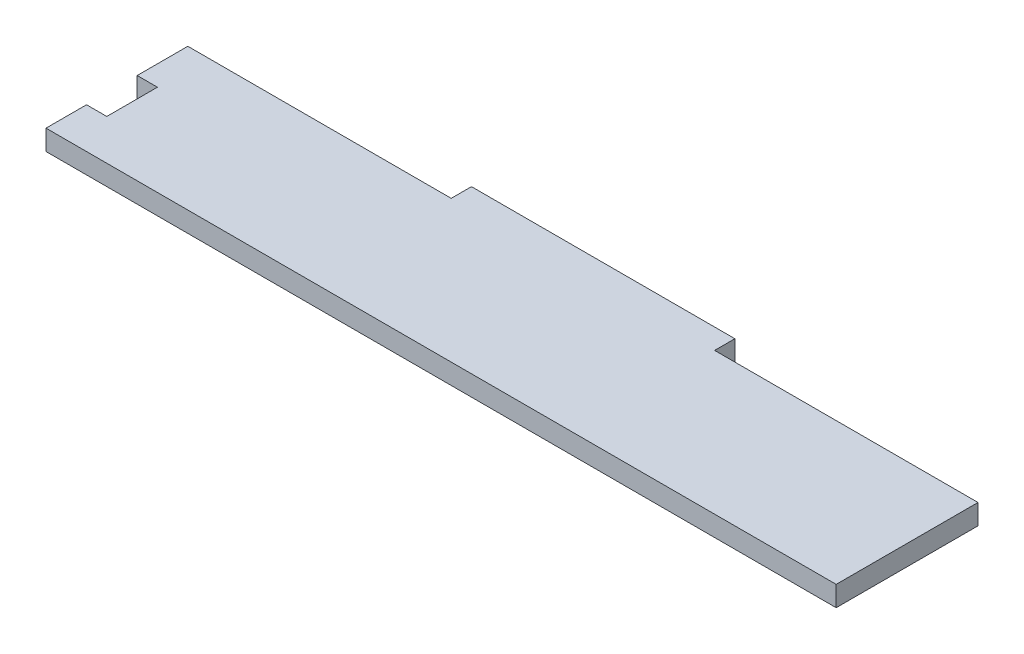
ISO-10303-21;
HEADER;
FILE_DESCRIPTION(('STEP AP214'),'2;1');
FILE_NAME('part.step','',(''),(''),'','','');
FILE_SCHEMA(('AUTOMOTIVE_DESIGN { 1 0 10303 214 1 1 1 1 }'));
ENDSEC;
DATA;
#1=APPLICATION_CONTEXT('core data for automotive mechanical design processes');
#2=APPLICATION_PROTOCOL_DEFINITION('international standard','automotive_design',2000,#1);
#3=PRODUCT_CONTEXT('',#1,'mechanical');
#4=PRODUCT('Part','Part','',(#3));
#5=PRODUCT_RELATED_PRODUCT_CATEGORY('part','',(#4));
#6=PRODUCT_DEFINITION_FORMATION('','',#4);
#7=PRODUCT_DEFINITION_CONTEXT('part definition',#1,'design');
#8=PRODUCT_DEFINITION('design','',#6,#7);
#9=PRODUCT_DEFINITION_SHAPE('','',#8);
#10=(LENGTH_UNIT() NAMED_UNIT(*) SI_UNIT(.MILLI.,.METRE.));
#11=(NAMED_UNIT(*) PLANE_ANGLE_UNIT() SI_UNIT($,.RADIAN.));
#12=(NAMED_UNIT(*) SI_UNIT($,.STERADIAN.) SOLID_ANGLE_UNIT());
#13=UNCERTAINTY_MEASURE_WITH_UNIT(LENGTH_MEASURE(1.E-05),#10,'distance_accuracy_value','');
#14=(GEOMETRIC_REPRESENTATION_CONTEXT(3) GLOBAL_UNCERTAINTY_ASSIGNED_CONTEXT((#13)) GLOBAL_UNIT_ASSIGNED_CONTEXT((#10,
#11,#12)) REPRESENTATION_CONTEXT('',''));
#15=CARTESIAN_POINT('',(0.,0.,0.));
#16=DIRECTION('',(0.,0.,1.));
#17=DIRECTION('',(1.,0.,0.));
#18=AXIS2_PLACEMENT_3D('',#15,#16,#17);
#19=CARTESIAN_POINT('',(0.,10.,-140.));
#20=DIRECTION('',(-1.,0.,0.));
#21=DIRECTION('',(0.,0.,1.));
#22=AXIS2_PLACEMENT_3D('',#19,#20,#21);
#23=PLANE('',#22);
#24=DIRECTION('',(0.,0.,-1.));
#25=VECTOR('',#24,1.);
#26=CARTESIAN_POINT('',(0.,0.,-140.));
#27=LINE('',#26,#25);
#28=CARTESIAN_POINT('',(0.,0.,-70.));
#29=VERTEX_POINT('',#28);
#30=CARTESIAN_POINT('',(0.,0.,-140.));
#31=VERTEX_POINT('',#30);
#32=EDGE_CURVE('E156',#29,#31,#27,.T.);
#33=ORIENTED_EDGE('',*,*,#32,.T.);
#34=DIRECTION('',(0.,-1.,0.));
#35=VECTOR('',#34,1.);
#36=CARTESIAN_POINT('',(0.,10.,-140.));
#37=LINE('',#36,#35);
#38=CARTESIAN_POINT('',(0.,10.,-140.));
#39=VERTEX_POINT('',#38);
#40=EDGE_CURVE('E11',#39,#31,#37,.T.);
#41=ORIENTED_EDGE('',*,*,#40,.F.);
#42=DIRECTION('',(0.,0.,-1.));
#43=VECTOR('',#42,1.);
#44=CARTESIAN_POINT('',(0.,10.,-140.));
#45=LINE('',#44,#43);
#46=CARTESIAN_POINT('',(0.,10.,-70.));
#47=VERTEX_POINT('',#46);
#48=EDGE_CURVE('E178',#47,#39,#45,.T.);
#49=ORIENTED_EDGE('',*,*,#48,.F.);
#50=DIRECTION('',(0.,-1.,0.));
#51=VECTOR('',#50,1.);
#52=CARTESIAN_POINT('',(0.,10.,-70.));
#53=LINE('',#52,#51);
#54=EDGE_CURVE('E152',#47,#29,#53,.T.);
#55=ORIENTED_EDGE('',*,*,#54,.T.);
#56=EDGE_LOOP('',(#33,#41,#49,#55));
#57=FACE_BOUND('',#56,.T.);
#58=ADVANCED_FACE('F36',(#57),#23,.F.);
#59=CARTESIAN_POINT('',(0.,10.,-140.));
#60=DIRECTION('',(0.,0.,1.));
#61=DIRECTION('',(1.,0.,0.));
#62=AXIS2_PLACEMENT_3D('',#59,#60,#61);
#63=PLANE('',#62);
#64=DIRECTION('',(-1.,0.,0.));
#65=VECTOR('',#64,1.);
#66=CARTESIAN_POINT('',(0.,0.,-140.));
#67=LINE('',#66,#65);
#68=CARTESIAN_POINT('',(-130.,0.,-140.));
#69=VERTEX_POINT('',#68);
#70=EDGE_CURVE('E159',#31,#69,#67,.T.);
#71=ORIENTED_EDGE('',*,*,#70,.T.);
#72=DIRECTION('',(0.,-1.,0.));
#73=VECTOR('',#72,1.);
#74=CARTESIAN_POINT('',(-130.,10.,-140.));
#75=LINE('',#74,#73);
#76=CARTESIAN_POINT('',(-130.,10.,-140.));
#77=VERTEX_POINT('',#76);
#78=EDGE_CURVE('E44',#77,#69,#75,.T.);
#79=ORIENTED_EDGE('',*,*,#78,.F.);
#80=DIRECTION('',(-1.,0.,0.));
#81=VECTOR('',#80,1.);
#82=CARTESIAN_POINT('',(0.,10.,-140.));
#83=LINE('',#82,#81);
#84=EDGE_CURVE('E107',#39,#77,#83,.T.);
#85=ORIENTED_EDGE('',*,*,#84,.F.);
#86=ORIENTED_EDGE('',*,*,#40,.T.);
#87=EDGE_LOOP('',(#71,#79,#85,#86));
#88=FACE_BOUND('',#87,.T.);
#89=ADVANCED_FACE('F256',(#88),#63,.F.);
#90=CARTESIAN_POINT('',(-130.,10.,-140.));
#91=DIRECTION('',(-1.,0.,0.));
#92=DIRECTION('',(0.,0.,1.));
#93=AXIS2_PLACEMENT_3D('',#90,#91,#92);
#94=PLANE('',#93);
#95=DIRECTION('',(0.,0.,-1.));
#96=VECTOR('',#95,1.);
#97=CARTESIAN_POINT('',(-130.,0.,-140.));
#98=LINE('',#97,#96);
#99=CARTESIAN_POINT('',(-130.,0.,-150.));
#100=VERTEX_POINT('',#99);
#101=EDGE_CURVE('E161',#69,#100,#98,.T.);
#102=ORIENTED_EDGE('',*,*,#101,.T.);
#103=DIRECTION('',(0.,-1.,0.));
#104=VECTOR('',#103,1.);
#105=CARTESIAN_POINT('',(-130.,10.,-150.));
#106=LINE('',#105,#104);
#107=CARTESIAN_POINT('',(-130.,10.,-150.));
#108=VERTEX_POINT('',#107);
#109=EDGE_CURVE('E197',#108,#100,#106,.T.);
#110=ORIENTED_EDGE('',*,*,#109,.F.);
#111=DIRECTION('',(0.,0.,-1.));
#112=VECTOR('',#111,1.);
#113=CARTESIAN_POINT('',(-130.,10.,-140.));
#114=LINE('',#113,#112);
#115=EDGE_CURVE('E205',#77,#108,#114,.T.);
#116=ORIENTED_EDGE('',*,*,#115,.F.);
#117=ORIENTED_EDGE('',*,*,#78,.T.);
#118=EDGE_LOOP('',(#102,#110,#116,#117));
#119=FACE_BOUND('',#118,.T.);
#120=ADVANCED_FACE('F203',(#119),#94,.F.);
#121=CARTESIAN_POINT('',(-130.,10.,-150.));
#122=DIRECTION('',(0.,0.,1.));
#123=DIRECTION('',(1.,0.,0.));
#124=AXIS2_PLACEMENT_3D('',#121,#122,#123);
#125=PLANE('',#124);
#126=DIRECTION('',(-1.,0.,0.));
#127=VECTOR('',#126,1.);
#128=CARTESIAN_POINT('',(-130.,0.,-150.));
#129=LINE('',#128,#127);
#130=CARTESIAN_POINT('',(-260.,0.,-150.));
#131=VERTEX_POINT('',#130);
#132=EDGE_CURVE('E163',#100,#131,#129,.T.);
#133=ORIENTED_EDGE('',*,*,#132,.T.);
#134=DIRECTION('',(0.,-1.,0.));
#135=VECTOR('',#134,1.);
#136=CARTESIAN_POINT('',(-260.,10.,-150.));
#137=LINE('',#136,#135);
#138=CARTESIAN_POINT('',(-260.,10.,-150.));
#139=VERTEX_POINT('',#138);
#140=EDGE_CURVE('E194',#139,#131,#137,.T.);
#141=ORIENTED_EDGE('',*,*,#140,.F.);
#142=DIRECTION('',(-1.,0.,0.));
#143=VECTOR('',#142,1.);
#144=CARTESIAN_POINT('',(-130.,10.,-150.));
#145=LINE('',#144,#143);
#146=EDGE_CURVE('E223',#108,#139,#145,.T.);
#147=ORIENTED_EDGE('',*,*,#146,.F.);
#148=ORIENTED_EDGE('',*,*,#109,.T.);
#149=EDGE_LOOP('',(#133,#141,#147,#148));
#150=FACE_BOUND('',#149,.T.);
#151=ADVANCED_FACE('F214',(#150),#125,.F.);
#152=CARTESIAN_POINT('',(-260.,10.,-150.));
#153=DIRECTION('',(1.,0.,0.));
#154=DIRECTION('',(0.,0.,-1.));
#155=AXIS2_PLACEMENT_3D('',#152,#153,#154);
#156=PLANE('',#155);
#157=DIRECTION('',(0.,0.,1.));
#158=VECTOR('',#157,1.);
#159=CARTESIAN_POINT('',(-260.,0.,-150.));
#160=LINE('',#159,#158);
#161=CARTESIAN_POINT('',(-260.,0.,-140.));
#162=VERTEX_POINT('',#161);
#163=EDGE_CURVE('E165',#131,#162,#160,.T.);
#164=ORIENTED_EDGE('',*,*,#163,.T.);
#165=DIRECTION('',(0.,-1.,0.));
#166=VECTOR('',#165,1.);
#167=CARTESIAN_POINT('',(-260.,10.,-140.));
#168=LINE('',#167,#166);
#169=CARTESIAN_POINT('',(-260.,10.,-140.));
#170=VERTEX_POINT('',#169);
#171=EDGE_CURVE('E191',#170,#162,#168,.T.);
#172=ORIENTED_EDGE('',*,*,#171,.F.);
#173=DIRECTION('',(0.,0.,1.));
#174=VECTOR('',#173,1.);
#175=CARTESIAN_POINT('',(-260.,10.,-150.));
#176=LINE('',#175,#174);
#177=EDGE_CURVE('E220',#139,#170,#176,.T.);
#178=ORIENTED_EDGE('',*,*,#177,.F.);
#179=ORIENTED_EDGE('',*,*,#140,.T.);
#180=EDGE_LOOP('',(#164,#172,#178,#179));
#181=FACE_BOUND('',#180,.T.);
#182=ADVANCED_FACE('F218',(#181),#156,.F.);
#183=CARTESIAN_POINT('',(-260.,10.,-140.));
#184=DIRECTION('',(0.,0.,1.));
#185=DIRECTION('',(1.,0.,0.));
#186=AXIS2_PLACEMENT_3D('',#183,#184,#185);
#187=PLANE('',#186);
#188=DIRECTION('',(-1.,0.,0.));
#189=VECTOR('',#188,1.);
#190=CARTESIAN_POINT('',(-260.,0.,-140.));
#191=LINE('',#190,#189);
#192=CARTESIAN_POINT('',(-390.,0.,-140.));
#193=VERTEX_POINT('',#192);
#194=EDGE_CURVE('E167',#162,#193,#191,.T.);
#195=ORIENTED_EDGE('',*,*,#194,.T.);
#196=DIRECTION('',(0.,-1.,0.));
#197=VECTOR('',#196,1.);
#198=CARTESIAN_POINT('',(-390.,10.,-140.));
#199=LINE('',#198,#197);
#200=CARTESIAN_POINT('',(-390.,10.,-140.));
#201=VERTEX_POINT('',#200);
#202=EDGE_CURVE('E188',#201,#193,#199,.T.);
#203=ORIENTED_EDGE('',*,*,#202,.F.);
#204=DIRECTION('',(-1.,0.,0.));
#205=VECTOR('',#204,1.);
#206=CARTESIAN_POINT('',(-260.,10.,-140.));
#207=LINE('',#206,#205);
#208=EDGE_CURVE('E222',#170,#201,#207,.T.);
#209=ORIENTED_EDGE('',*,*,#208,.F.);
#210=ORIENTED_EDGE('',*,*,#171,.T.);
#211=EDGE_LOOP('',(#195,#203,#209,#210));
#212=FACE_BOUND('',#211,.T.);
#213=ADVANCED_FACE('F269',(#212),#187,.F.);
#214=CARTESIAN_POINT('',(-390.,10.,-115.));
#215=DIRECTION('',(1.,0.,0.));
#216=DIRECTION('',(0.,0.,-1.));
#217=AXIS2_PLACEMENT_3D('',#214,#215,#216);
#218=PLANE('',#217);
#219=DIRECTION('',(0.,0.,1.));
#220=VECTOR('',#219,1.);
#221=CARTESIAN_POINT('',(-390.,0.,-115.));
#222=LINE('',#221,#220);
#223=CARTESIAN_POINT('',(-390.,0.,-115.));
#224=VERTEX_POINT('',#223);
#225=EDGE_CURVE('E169',#193,#224,#222,.T.);
#226=ORIENTED_EDGE('',*,*,#225,.T.);
#227=DIRECTION('',(0.,-1.,0.));
#228=VECTOR('',#227,1.);
#229=CARTESIAN_POINT('',(-390.,10.,-115.));
#230=LINE('',#229,#228);
#231=CARTESIAN_POINT('',(-390.,10.,-115.));
#232=VERTEX_POINT('',#231);
#233=EDGE_CURVE('E185',#232,#224,#230,.T.);
#234=ORIENTED_EDGE('',*,*,#233,.F.);
#235=DIRECTION('',(0.,0.,1.));
#236=VECTOR('',#235,1.);
#237=CARTESIAN_POINT('',(-390.,10.,-115.));
#238=LINE('',#237,#236);
#239=EDGE_CURVE('E225',#201,#232,#238,.T.);
#240=ORIENTED_EDGE('',*,*,#239,.F.);
#241=ORIENTED_EDGE('',*,*,#202,.T.);
#242=EDGE_LOOP('',(#226,#234,#240,#241));
#243=FACE_BOUND('',#242,.T.);
#244=ADVANCED_FACE('F272',(#243),#218,.F.);
#245=CARTESIAN_POINT('',(-380.,10.,-115.));
#246=DIRECTION('',(0.,0.,-1.));
#247=DIRECTION('',(-1.,0.,0.));
#248=AXIS2_PLACEMENT_3D('',#245,#246,#247);
#249=PLANE('',#248);
#250=DIRECTION('',(1.,0.,0.));
#251=VECTOR('',#250,1.);
#252=CARTESIAN_POINT('',(-380.,0.,-115.));
#253=LINE('',#252,#251);
#254=CARTESIAN_POINT('',(-380.,0.,-115.));
#255=VERTEX_POINT('',#254);
#256=EDGE_CURVE('E171',#224,#255,#253,.T.);
#257=ORIENTED_EDGE('',*,*,#256,.T.);
#258=DIRECTION('',(0.,-1.,0.));
#259=VECTOR('',#258,1.);
#260=CARTESIAN_POINT('',(-380.,10.,-115.));
#261=LINE('',#260,#259);
#262=CARTESIAN_POINT('',(-380.,10.,-115.));
#263=VERTEX_POINT('',#262);
#264=EDGE_CURVE('E182',#263,#255,#261,.T.);
#265=ORIENTED_EDGE('',*,*,#264,.F.);
#266=DIRECTION('',(1.,0.,0.));
#267=VECTOR('',#266,1.);
#268=CARTESIAN_POINT('',(-380.,10.,-115.));
#269=LINE('',#268,#267);
#270=EDGE_CURVE('E231',#232,#263,#269,.T.);
#271=ORIENTED_EDGE('',*,*,#270,.F.);
#272=ORIENTED_EDGE('',*,*,#233,.T.);
#273=EDGE_LOOP('',(#257,#265,#271,#272));
#274=FACE_BOUND('',#273,.T.);
#275=ADVANCED_FACE('F237',(#274),#249,.F.);
#276=CARTESIAN_POINT('',(-380.,10.,-90.));
#277=DIRECTION('',(1.,0.,0.));
#278=DIRECTION('',(0.,0.,-1.));
#279=AXIS2_PLACEMENT_3D('',#276,#277,#278);
#280=PLANE('',#279);
#281=DIRECTION('',(0.,0.,1.));
#282=VECTOR('',#281,1.);
#283=CARTESIAN_POINT('',(-380.,0.,-90.));
#284=LINE('',#283,#282);
#285=CARTESIAN_POINT('',(-380.,0.,-90.));
#286=VERTEX_POINT('',#285);
#287=EDGE_CURVE('E173',#255,#286,#284,.T.);
#288=ORIENTED_EDGE('',*,*,#287,.T.);
#289=DIRECTION('',(0.,-1.,0.));
#290=VECTOR('',#289,1.);
#291=CARTESIAN_POINT('',(-380.,10.,-90.));
#292=LINE('',#291,#290);
#293=CARTESIAN_POINT('',(-380.,10.,-90.));
#294=VERTEX_POINT('',#293);
#295=EDGE_CURVE('E147',#294,#286,#292,.T.);
#296=ORIENTED_EDGE('',*,*,#295,.F.);
#297=DIRECTION('',(0.,0.,1.));
#298=VECTOR('',#297,1.);
#299=CARTESIAN_POINT('',(-380.,10.,-90.));
#300=LINE('',#299,#298);
#301=EDGE_CURVE('E138',#263,#294,#300,.T.);
#302=ORIENTED_EDGE('',*,*,#301,.F.);
#303=ORIENTED_EDGE('',*,*,#264,.T.);
#304=EDGE_LOOP('',(#288,#296,#302,#303));
#305=FACE_BOUND('',#304,.T.);
#306=ADVANCED_FACE('F241',(#305),#280,.F.);
#307=CARTESIAN_POINT('',(-390.,10.,-90.));
#308=DIRECTION('',(0.,0.,1.));
#309=DIRECTION('',(1.,0.,0.));
#310=AXIS2_PLACEMENT_3D('',#307,#308,#309);
#311=PLANE('',#310);
#312=DIRECTION('',(-1.,0.,0.));
#313=VECTOR('',#312,1.);
#314=CARTESIAN_POINT('',(-390.,0.,-90.));
#315=LINE('',#314,#313);
#316=CARTESIAN_POINT('',(-390.,0.,-90.));
#317=VERTEX_POINT('',#316);
#318=EDGE_CURVE('E146',#286,#317,#315,.T.);
#319=ORIENTED_EDGE('',*,*,#318,.T.);
#320=DIRECTION('',(0.,-1.,0.));
#321=VECTOR('',#320,1.);
#322=CARTESIAN_POINT('',(-390.,10.,-90.));
#323=LINE('',#322,#321);
#324=CARTESIAN_POINT('',(-390.,10.,-90.));
#325=VERTEX_POINT('',#324);
#326=EDGE_CURVE('E143',#325,#317,#323,.T.);
#327=ORIENTED_EDGE('',*,*,#326,.F.);
#328=DIRECTION('',(-1.,0.,0.));
#329=VECTOR('',#328,1.);
#330=CARTESIAN_POINT('',(-390.,10.,-90.));
#331=LINE('',#330,#329);
#332=EDGE_CURVE('E132',#294,#325,#331,.T.);
#333=ORIENTED_EDGE('',*,*,#332,.F.);
#334=ORIENTED_EDGE('',*,*,#295,.T.);
#335=EDGE_LOOP('',(#319,#327,#333,#334));
#336=FACE_BOUND('',#335,.T.);
#337=ADVANCED_FACE('F144',(#336),#311,.F.);
#338=CARTESIAN_POINT('',(-390.,10.,-70.));
#339=DIRECTION('',(1.,0.,0.));
#340=DIRECTION('',(0.,0.,-1.));
#341=AXIS2_PLACEMENT_3D('',#338,#339,#340);
#342=PLANE('',#341);
#343=DIRECTION('',(0.,0.,1.));
#344=VECTOR('',#343,1.);
#345=CARTESIAN_POINT('',(-390.,0.,-70.));
#346=LINE('',#345,#344);
#347=CARTESIAN_POINT('',(-390.,0.,-70.));
#348=VERTEX_POINT('',#347);
#349=EDGE_CURVE('E93',#317,#348,#346,.T.);
#350=ORIENTED_EDGE('',*,*,#349,.T.);
#351=DIRECTION('',(0.,-1.,0.));
#352=VECTOR('',#351,1.);
#353=CARTESIAN_POINT('',(-390.,10.,-70.));
#354=LINE('',#353,#352);
#355=CARTESIAN_POINT('',(-390.,10.,-70.));
#356=VERTEX_POINT('',#355);
#357=EDGE_CURVE('E148',#356,#348,#354,.T.);
#358=ORIENTED_EDGE('',*,*,#357,.F.);
#359=DIRECTION('',(0.,0.,1.));
#360=VECTOR('',#359,1.);
#361=CARTESIAN_POINT('',(-390.,10.,-70.));
#362=LINE('',#361,#360);
#363=EDGE_CURVE('E136',#325,#356,#362,.T.);
#364=ORIENTED_EDGE('',*,*,#363,.F.);
#365=ORIENTED_EDGE('',*,*,#326,.T.);
#366=EDGE_LOOP('',(#350,#358,#364,#365));
#367=FACE_BOUND('',#366,.T.);
#368=ADVANCED_FACE('F150',(#367),#342,.F.);
#369=CARTESIAN_POINT('',(0.,10.,-70.));
#370=DIRECTION('',(0.,0.,-1.));
#371=DIRECTION('',(-1.,0.,0.));
#372=AXIS2_PLACEMENT_3D('',#369,#370,#371);
#373=PLANE('',#372);
#374=DIRECTION('',(1.,0.,0.));
#375=VECTOR('',#374,1.);
#376=CARTESIAN_POINT('',(0.,0.,-70.));
#377=LINE('',#376,#375);
#378=EDGE_CURVE('E99',#348,#29,#377,.T.);
#379=ORIENTED_EDGE('',*,*,#378,.T.);
#380=ORIENTED_EDGE('',*,*,#54,.F.);
#381=DIRECTION('',(1.,0.,0.));
#382=VECTOR('',#381,1.);
#383=CARTESIAN_POINT('',(0.,10.,-70.));
#384=LINE('',#383,#382);
#385=EDGE_CURVE('E52',#356,#47,#384,.T.);
#386=ORIENTED_EDGE('',*,*,#385,.F.);
#387=ORIENTED_EDGE('',*,*,#357,.T.);
#388=EDGE_LOOP('',(#379,#380,#386,#387));
#389=FACE_BOUND('',#388,.T.);
#390=ADVANCED_FACE('F245',(#389),#373,.F.);
#391=CARTESIAN_POINT('',(0.,10.,0.));
#392=DIRECTION('',(0.,-1.,0.));
#393=DIRECTION('',(0.,0.,-1.));
#394=AXIS2_PLACEMENT_3D('',#391,#392,#393);
#395=PLANE('',#394);
#396=ORIENTED_EDGE('',*,*,#48,.T.);
#397=ORIENTED_EDGE('',*,*,#84,.T.);
#398=ORIENTED_EDGE('',*,*,#115,.T.);
#399=ORIENTED_EDGE('',*,*,#146,.T.);
#400=ORIENTED_EDGE('',*,*,#177,.T.);
#401=ORIENTED_EDGE('',*,*,#208,.T.);
#402=ORIENTED_EDGE('',*,*,#239,.T.);
#403=ORIENTED_EDGE('',*,*,#270,.T.);
#404=ORIENTED_EDGE('',*,*,#301,.T.);
#405=ORIENTED_EDGE('',*,*,#332,.T.);
#406=ORIENTED_EDGE('',*,*,#363,.T.);
#407=ORIENTED_EDGE('',*,*,#385,.T.);
#408=EDGE_LOOP('',(#396,#397,#398,#399,#400,#401,#402,#403,#404,#405,#406,#407));
#409=FACE_BOUND('',#408,.T.);
#410=ADVANCED_FACE('F134',(#409),#395,.F.);
#411=CARTESIAN_POINT('',(0.,0.,0.));
#412=DIRECTION('',(0.,-1.,0.));
#413=DIRECTION('',(0.,0.,-1.));
#414=AXIS2_PLACEMENT_3D('',#411,#412,#413);
#415=PLANE('',#414);
#416=ORIENTED_EDGE('',*,*,#32,.F.);
#417=ORIENTED_EDGE('',*,*,#378,.F.);
#418=ORIENTED_EDGE('',*,*,#349,.F.);
#419=ORIENTED_EDGE('',*,*,#318,.F.);
#420=ORIENTED_EDGE('',*,*,#287,.F.);
#421=ORIENTED_EDGE('',*,*,#256,.F.);
#422=ORIENTED_EDGE('',*,*,#225,.F.);
#423=ORIENTED_EDGE('',*,*,#194,.F.);
#424=ORIENTED_EDGE('',*,*,#163,.F.);
#425=ORIENTED_EDGE('',*,*,#132,.F.);
#426=ORIENTED_EDGE('',*,*,#101,.F.);
#427=ORIENTED_EDGE('',*,*,#70,.F.);
#428=EDGE_LOOP('',(#416,#417,#418,#419,#420,#421,#422,#423,#424,#425,#426,#427));
#429=FACE_BOUND('',#428,.T.);
#430=ADVANCED_FACE('F209',(#429),#415,.T.);
#431=CLOSED_SHELL('',(#58,#89,#120,#151,#182,#213,#244,#275,#306,#337,#368,#390,#410,#430));
#432=MANIFOLD_SOLID_BREP('B2',#431);
#433=ADVANCED_BREP_SHAPE_REPRESENTATION('',(#18,#432),#14);
#434=SHAPE_DEFINITION_REPRESENTATION(#9,#433);
ENDSEC;
END-ISO-10303-21;
